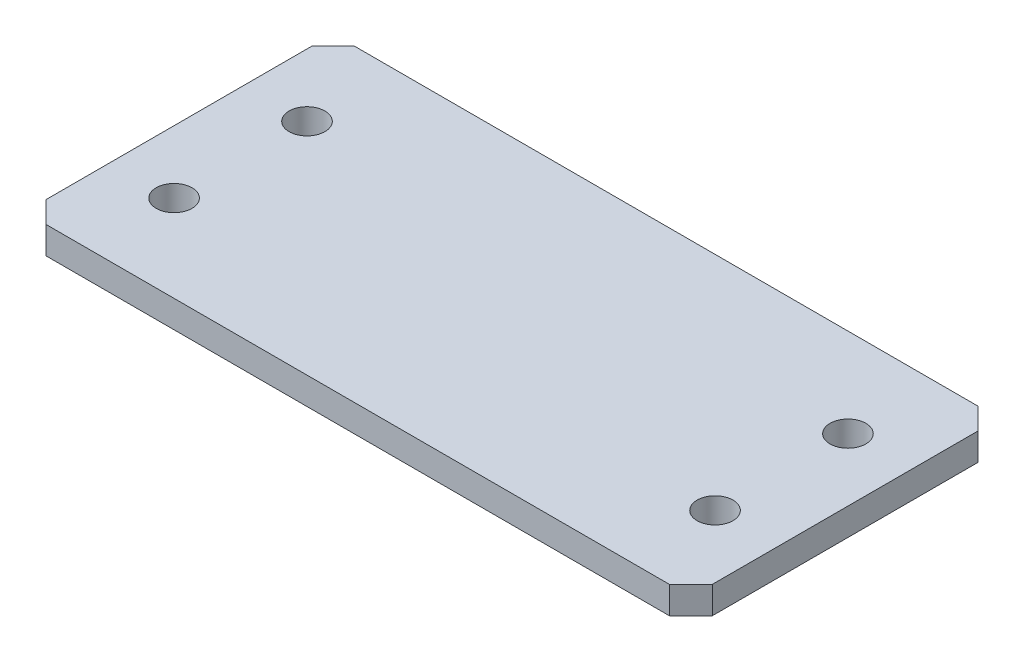
ISO-10303-21;
HEADER;
FILE_DESCRIPTION(('STEP AP214'),'2;1');
FILE_NAME('part.step','',(''),(''),'','','');
FILE_SCHEMA(('AUTOMOTIVE_DESIGN { 1 0 10303 214 1 1 1 1 }'));
ENDSEC;
DATA;
#1=APPLICATION_CONTEXT('core data for automotive mechanical design processes');
#2=APPLICATION_PROTOCOL_DEFINITION('international standard','automotive_design',2000,#1);
#3=PRODUCT_CONTEXT('',#1,'mechanical');
#4=PRODUCT('Part','Part','',(#3));
#5=PRODUCT_RELATED_PRODUCT_CATEGORY('part','',(#4));
#6=PRODUCT_DEFINITION_FORMATION('','',#4);
#7=PRODUCT_DEFINITION_CONTEXT('part definition',#1,'design');
#8=PRODUCT_DEFINITION('design','',#6,#7);
#9=PRODUCT_DEFINITION_SHAPE('','',#8);
#10=(LENGTH_UNIT() NAMED_UNIT(*) SI_UNIT(.MILLI.,.METRE.));
#11=(NAMED_UNIT(*) PLANE_ANGLE_UNIT() SI_UNIT($,.RADIAN.));
#12=(NAMED_UNIT(*) SI_UNIT($,.STERADIAN.) SOLID_ANGLE_UNIT());
#13=UNCERTAINTY_MEASURE_WITH_UNIT(LENGTH_MEASURE(1.E-05),#10,'distance_accuracy_value','');
#14=(GEOMETRIC_REPRESENTATION_CONTEXT(3) GLOBAL_UNCERTAINTY_ASSIGNED_CONTEXT((#13)) GLOBAL_UNIT_ASSIGNED_CONTEXT((#10,
#11,#12)) REPRESENTATION_CONTEXT('',''));
#15=CARTESIAN_POINT('',(0.,0.,0.));
#16=DIRECTION('',(0.,0.,1.));
#17=DIRECTION('',(1.,0.,0.));
#18=AXIS2_PLACEMENT_3D('',#15,#16,#17);
#19=CARTESIAN_POINT('',(18.6,0.,8.615));
#20=DIRECTION('',(0.,1.,0.));
#21=DIRECTION('',(0.,0.,1.));
#22=AXIS2_PLACEMENT_3D('',#19,#20,#21);
#23=PLANE('',#22);
#24=CARTESIAN_POINT('',(33.7,0.,12.38));
#25=DIRECTION('',(0.,-1.,0.));
#26=DIRECTION('',(0.,0.,-1.));
#27=AXIS2_PLACEMENT_3D('',#24,#25,#26);
#28=CIRCLE('',#27,1.);
#29=CARTESIAN_POINT('',(33.7,0.,11.38));
#30=VERTEX_POINT('',#29);
#31=EDGE_CURVE('E116',#30,#30,#28,.F.);
#32=ORIENTED_EDGE('',*,*,#31,.T.);
#33=EDGE_LOOP('',(#32));
#34=FACE_BOUND('',#33,.T.);
#35=CARTESIAN_POINT('',(3.5,0.,4.96));
#36=DIRECTION('',(0.,-1.,0.));
#37=DIRECTION('',(0.,0.,-1.));
#38=AXIS2_PLACEMENT_3D('',#35,#36,#37);
#39=CIRCLE('',#38,1.);
#40=CARTESIAN_POINT('',(3.5,0.,3.96));
#41=VERTEX_POINT('',#40);
#42=EDGE_CURVE('E120',#41,#41,#39,.F.);
#43=ORIENTED_EDGE('',*,*,#42,.T.);
#44=EDGE_LOOP('',(#43));
#45=FACE_BOUND('',#44,.T.);
#46=CARTESIAN_POINT('',(33.7,0.,4.96));
#47=DIRECTION('',(0.,-1.,0.));
#48=DIRECTION('',(0.,0.,-1.));
#49=AXIS2_PLACEMENT_3D('',#46,#47,#48);
#50=CIRCLE('',#49,1.);
#51=CARTESIAN_POINT('',(33.7,0.,3.96));
#52=VERTEX_POINT('',#51);
#53=EDGE_CURVE('E122',#52,#52,#50,.F.);
#54=ORIENTED_EDGE('',*,*,#53,.T.);
#55=EDGE_LOOP('',(#54));
#56=FACE_BOUND('',#55,.T.);
#57=CARTESIAN_POINT('',(3.5,0.,12.38));
#58=DIRECTION('',(0.,-1.,0.));
#59=DIRECTION('',(0.,0.,-1.));
#60=AXIS2_PLACEMENT_3D('',#57,#58,#59);
#61=CIRCLE('',#60,1.);
#62=CARTESIAN_POINT('',(3.5,0.,11.38));
#63=VERTEX_POINT('',#62);
#64=EDGE_CURVE('E20',#63,#63,#61,.F.);
#65=ORIENTED_EDGE('',*,*,#64,.T.);
#66=EDGE_LOOP('',(#65));
#67=FACE_BOUND('',#66,.T.);
#68=DIRECTION('',(1.,0.,0.));
#69=VECTOR('',#68,1.);
#70=CARTESIAN_POINT('',(1.2,0.,17.23));
#71=LINE('',#70,#69);
#72=CARTESIAN_POINT('',(1.2,0.,17.23));
#73=VERTEX_POINT('',#72);
#74=CARTESIAN_POINT('',(36.,0.,17.23));
#75=VERTEX_POINT('',#74);
#76=EDGE_CURVE('E131',#73,#75,#71,.T.);
#77=ORIENTED_EDGE('',*,*,#76,.F.);
#78=DIRECTION('',(0.707106781186548,0.,0.707106781186548));
#79=VECTOR('',#78,1.);
#80=CARTESIAN_POINT('',(0.,0.,16.03));
#81=LINE('',#80,#79);
#82=CARTESIAN_POINT('',(0.,0.,16.03));
#83=VERTEX_POINT('',#82);
#84=EDGE_CURVE('E140',#83,#73,#81,.T.);
#85=ORIENTED_EDGE('',*,*,#84,.F.);
#86=DIRECTION('',(0.,0.,1.));
#87=VECTOR('',#86,1.);
#88=CARTESIAN_POINT('',(0.,0.,1.2));
#89=LINE('',#88,#87);
#90=CARTESIAN_POINT('',(0.,0.,1.2));
#91=VERTEX_POINT('',#90);
#92=EDGE_CURVE('E145',#91,#83,#89,.T.);
#93=ORIENTED_EDGE('',*,*,#92,.F.);
#94=DIRECTION('',(-0.707106781186548,0.,0.707106781186548));
#95=VECTOR('',#94,1.);
#96=CARTESIAN_POINT('',(1.2,0.,0.));
#97=LINE('',#96,#95);
#98=CARTESIAN_POINT('',(1.2,0.,0.));
#99=VERTEX_POINT('',#98);
#100=EDGE_CURVE('E151',#99,#91,#97,.T.);
#101=ORIENTED_EDGE('',*,*,#100,.F.);
#102=DIRECTION('',(-1.,0.,0.));
#103=VECTOR('',#102,1.);
#104=CARTESIAN_POINT('',(36.,0.,0.));
#105=LINE('',#104,#103);
#106=CARTESIAN_POINT('',(36.,0.,0.));
#107=VERTEX_POINT('',#106);
#108=EDGE_CURVE('E157',#107,#99,#105,.T.);
#109=ORIENTED_EDGE('',*,*,#108,.F.);
#110=DIRECTION('',(-0.707106781186548,0.,-0.707106781186548));
#111=VECTOR('',#110,1.);
#112=CARTESIAN_POINT('',(37.2,0.,1.2));
#113=LINE('',#112,#111);
#114=CARTESIAN_POINT('',(37.2,0.,1.2));
#115=VERTEX_POINT('',#114);
#116=EDGE_CURVE('E80',#115,#107,#113,.T.);
#117=ORIENTED_EDGE('',*,*,#116,.F.);
#118=DIRECTION('',(0.,0.,-1.));
#119=VECTOR('',#118,1.);
#120=CARTESIAN_POINT('',(37.2,0.,16.03));
#121=LINE('',#120,#119);
#122=CARTESIAN_POINT('',(37.2,0.,16.03));
#123=VERTEX_POINT('',#122);
#124=EDGE_CURVE('E82',#123,#115,#121,.T.);
#125=ORIENTED_EDGE('',*,*,#124,.F.);
#126=DIRECTION('',(0.707106781186548,0.,-0.707106781186548));
#127=VECTOR('',#126,1.);
#128=CARTESIAN_POINT('',(36.,0.,17.23));
#129=LINE('',#128,#127);
#130=EDGE_CURVE('E84',#75,#123,#129,.T.);
#131=ORIENTED_EDGE('',*,*,#130,.F.);
#132=EDGE_LOOP('',(#77,#85,#93,#101,#109,#117,#125,#131));
#133=FACE_BOUND('',#132,.T.);
#134=ADVANCED_FACE('F17',(#34,#45,#56,#67,#133),#23,.F.);
#135=CARTESIAN_POINT('',(36.,0.,17.23));
#136=DIRECTION('',(0.707106781186548,0.,0.707106781186548));
#137=DIRECTION('',(0.707106781186548,0.,-0.707106781186548));
#138=AXIS2_PLACEMENT_3D('',#135,#136,#137);
#139=PLANE('',#138);
#140=DIRECTION('',(0.707106781186547,0.,-0.707106781186547));
#141=VECTOR('',#140,1.);
#142=CARTESIAN_POINT('',(36.,1.52,17.23));
#143=LINE('',#142,#141);
#144=CARTESIAN_POINT('',(36.,1.52,17.23));
#145=VERTEX_POINT('',#144);
#146=CARTESIAN_POINT('',(37.2,1.52,16.03));
#147=VERTEX_POINT('',#146);
#148=EDGE_CURVE('E119',#145,#147,#143,.T.);
#149=ORIENTED_EDGE('',*,*,#148,.F.);
#150=DIRECTION('',(0.,1.,0.));
#151=VECTOR('',#150,1.);
#152=CARTESIAN_POINT('',(36.,0.,17.23));
#153=LINE('',#152,#151);
#154=EDGE_CURVE('E95',#75,#145,#153,.T.);
#155=ORIENTED_EDGE('',*,*,#154,.F.);
#156=ORIENTED_EDGE('',*,*,#130,.T.);
#157=DIRECTION('',(0.,1.,0.));
#158=VECTOR('',#157,1.);
#159=CARTESIAN_POINT('',(37.2,0.,16.03));
#160=LINE('',#159,#158);
#161=EDGE_CURVE('E89',#147,#123,#160,.F.);
#162=ORIENTED_EDGE('',*,*,#161,.F.);
#163=EDGE_LOOP('',(#149,#155,#156,#162));
#164=FACE_BOUND('',#163,.T.);
#165=ADVANCED_FACE('F92',(#164),#139,.T.);
#166=CARTESIAN_POINT('',(37.2,0.,16.03));
#167=DIRECTION('',(1.,0.,0.));
#168=DIRECTION('',(0.,0.,-1.));
#169=AXIS2_PLACEMENT_3D('',#166,#167,#168);
#170=PLANE('',#169);
#171=DIRECTION('',(0.,0.,1.));
#172=VECTOR('',#171,1.);
#173=CARTESIAN_POINT('',(37.2,1.52,8.615));
#174=LINE('',#173,#172);
#175=CARTESIAN_POINT('',(37.2,1.52,1.2));
#176=VERTEX_POINT('',#175);
#177=EDGE_CURVE('E100',#147,#176,#174,.F.);
#178=ORIENTED_EDGE('',*,*,#177,.F.);
#179=ORIENTED_EDGE('',*,*,#161,.T.);
#180=ORIENTED_EDGE('',*,*,#124,.T.);
#181=DIRECTION('',(0.,1.,0.));
#182=VECTOR('',#181,1.);
#183=CARTESIAN_POINT('',(37.2,0.,1.2));
#184=LINE('',#183,#182);
#185=EDGE_CURVE('E103',#176,#115,#184,.F.);
#186=ORIENTED_EDGE('',*,*,#185,.F.);
#187=EDGE_LOOP('',(#178,#179,#180,#186));
#188=FACE_BOUND('',#187,.T.);
#189=ADVANCED_FACE('F98',(#188),#170,.T.);
#190=CARTESIAN_POINT('',(37.2,0.,1.2));
#191=DIRECTION('',(0.707106781186548,0.,-0.707106781186548));
#192=DIRECTION('',(-0.707106781186548,0.,-0.707106781186548));
#193=AXIS2_PLACEMENT_3D('',#190,#191,#192);
#194=PLANE('',#193);
#195=DIRECTION('',(-0.707106781186547,0.,-0.707106781186547));
#196=VECTOR('',#195,1.);
#197=CARTESIAN_POINT('',(37.2,1.52,1.2));
#198=LINE('',#197,#196);
#199=CARTESIAN_POINT('',(36.,1.52,0.));
#200=VERTEX_POINT('',#199);
#201=EDGE_CURVE('E163',#176,#200,#198,.T.);
#202=ORIENTED_EDGE('',*,*,#201,.F.);
#203=ORIENTED_EDGE('',*,*,#185,.T.);
#204=ORIENTED_EDGE('',*,*,#116,.T.);
#205=DIRECTION('',(0.,1.,0.));
#206=VECTOR('',#205,1.);
#207=CARTESIAN_POINT('',(36.,0.,0.));
#208=LINE('',#207,#206);
#209=EDGE_CURVE('E154',#200,#107,#208,.F.);
#210=ORIENTED_EDGE('',*,*,#209,.F.);
#211=EDGE_LOOP('',(#202,#203,#204,#210));
#212=FACE_BOUND('',#211,.T.);
#213=ADVANCED_FACE('F161',(#212),#194,.T.);
#214=CARTESIAN_POINT('',(36.,0.,0.));
#215=DIRECTION('',(0.,0.,-1.));
#216=DIRECTION('',(-1.,0.,0.));
#217=AXIS2_PLACEMENT_3D('',#214,#215,#216);
#218=PLANE('',#217);
#219=DIRECTION('',(1.,0.,0.));
#220=VECTOR('',#219,1.);
#221=CARTESIAN_POINT('',(18.6,1.52,0.));
#222=LINE('',#221,#220);
#223=CARTESIAN_POINT('',(1.2,1.52,0.));
#224=VERTEX_POINT('',#223);
#225=EDGE_CURVE('E167',#200,#224,#222,.F.);
#226=ORIENTED_EDGE('',*,*,#225,.F.);
#227=ORIENTED_EDGE('',*,*,#209,.T.);
#228=ORIENTED_EDGE('',*,*,#108,.T.);
#229=DIRECTION('',(0.,1.,0.));
#230=VECTOR('',#229,1.);
#231=CARTESIAN_POINT('',(1.2,0.,0.));
#232=LINE('',#231,#230);
#233=EDGE_CURVE('E148',#224,#99,#232,.F.);
#234=ORIENTED_EDGE('',*,*,#233,.F.);
#235=EDGE_LOOP('',(#226,#227,#228,#234));
#236=FACE_BOUND('',#235,.T.);
#237=ADVANCED_FACE('F191',(#236),#218,.T.);
#238=CARTESIAN_POINT('',(1.2,0.,0.));
#239=DIRECTION('',(-0.707106781186548,0.,-0.707106781186548));
#240=DIRECTION('',(-0.707106781186548,0.,0.707106781186548));
#241=AXIS2_PLACEMENT_3D('',#238,#239,#240);
#242=PLANE('',#241);
#243=DIRECTION('',(-0.707106781186547,0.,0.707106781186547));
#244=VECTOR('',#243,1.);
#245=CARTESIAN_POINT('',(1.2,1.52,0.));
#246=LINE('',#245,#244);
#247=CARTESIAN_POINT('',(0.,1.52,1.2));
#248=VERTEX_POINT('',#247);
#249=EDGE_CURVE('E174',#224,#248,#246,.T.);
#250=ORIENTED_EDGE('',*,*,#249,.F.);
#251=ORIENTED_EDGE('',*,*,#233,.T.);
#252=ORIENTED_EDGE('',*,*,#100,.T.);
#253=DIRECTION('',(0.,1.,0.));
#254=VECTOR('',#253,1.);
#255=CARTESIAN_POINT('',(0.,0.,1.2));
#256=LINE('',#255,#254);
#257=EDGE_CURVE('E142',#248,#91,#256,.F.);
#258=ORIENTED_EDGE('',*,*,#257,.F.);
#259=EDGE_LOOP('',(#250,#251,#252,#258));
#260=FACE_BOUND('',#259,.T.);
#261=ADVANCED_FACE('F189',(#260),#242,.T.);
#262=CARTESIAN_POINT('',(0.,0.,1.2));
#263=DIRECTION('',(-1.,0.,0.));
#264=DIRECTION('',(0.,0.,1.));
#265=AXIS2_PLACEMENT_3D('',#262,#263,#264);
#266=PLANE('',#265);
#267=DIRECTION('',(0.,0.,1.));
#268=VECTOR('',#267,1.);
#269=CARTESIAN_POINT('',(0.,1.52,8.615));
#270=LINE('',#269,#268);
#271=CARTESIAN_POINT('',(0.,1.52,16.03));
#272=VERTEX_POINT('',#271);
#273=EDGE_CURVE('E177',#248,#272,#270,.T.);
#274=ORIENTED_EDGE('',*,*,#273,.F.);
#275=ORIENTED_EDGE('',*,*,#257,.T.);
#276=ORIENTED_EDGE('',*,*,#92,.T.);
#277=DIRECTION('',(0.,1.,0.));
#278=VECTOR('',#277,1.);
#279=CARTESIAN_POINT('',(0.,0.,16.03));
#280=LINE('',#279,#278);
#281=EDGE_CURVE('E137',#272,#83,#280,.F.);
#282=ORIENTED_EDGE('',*,*,#281,.F.);
#283=EDGE_LOOP('',(#274,#275,#276,#282));
#284=FACE_BOUND('',#283,.T.);
#285=ADVANCED_FACE('F186',(#284),#266,.T.);
#286=CARTESIAN_POINT('',(0.,0.,16.03));
#287=DIRECTION('',(-0.707106781186548,0.,0.707106781186548));
#288=DIRECTION('',(0.707106781186548,0.,0.707106781186548));
#289=AXIS2_PLACEMENT_3D('',#286,#287,#288);
#290=PLANE('',#289);
#291=DIRECTION('',(0.707106781186547,0.,0.707106781186547));
#292=VECTOR('',#291,1.);
#293=CARTESIAN_POINT('',(0.,1.52,16.03));
#294=LINE('',#293,#292);
#295=CARTESIAN_POINT('',(1.2,1.52,17.23));
#296=VERTEX_POINT('',#295);
#297=EDGE_CURVE('E180',#272,#296,#294,.T.);
#298=ORIENTED_EDGE('',*,*,#297,.F.);
#299=ORIENTED_EDGE('',*,*,#281,.T.);
#300=ORIENTED_EDGE('',*,*,#84,.T.);
#301=DIRECTION('',(0.,1.,0.));
#302=VECTOR('',#301,1.);
#303=CARTESIAN_POINT('',(1.2,0.,17.23));
#304=LINE('',#303,#302);
#305=EDGE_CURVE('E35',#296,#73,#304,.F.);
#306=ORIENTED_EDGE('',*,*,#305,.F.);
#307=EDGE_LOOP('',(#298,#299,#300,#306));
#308=FACE_BOUND('',#307,.T.);
#309=ADVANCED_FACE('F183',(#308),#290,.T.);
#310=CARTESIAN_POINT('',(1.2,0.,17.23));
#311=DIRECTION('',(0.,0.,1.));
#312=DIRECTION('',(1.,0.,0.));
#313=AXIS2_PLACEMENT_3D('',#310,#311,#312);
#314=PLANE('',#313);
#315=DIRECTION('',(1.,0.,0.));
#316=VECTOR('',#315,1.);
#317=CARTESIAN_POINT('',(18.6,1.52,17.23));
#318=LINE('',#317,#316);
#319=EDGE_CURVE('E115',#296,#145,#318,.T.);
#320=ORIENTED_EDGE('',*,*,#319,.F.);
#321=ORIENTED_EDGE('',*,*,#305,.T.);
#322=ORIENTED_EDGE('',*,*,#76,.T.);
#323=ORIENTED_EDGE('',*,*,#154,.T.);
#324=EDGE_LOOP('',(#320,#321,#322,#323));
#325=FACE_BOUND('',#324,.T.);
#326=ADVANCED_FACE('F182',(#325),#314,.T.);
#327=CARTESIAN_POINT('',(3.5,1.52,12.38));
#328=DIRECTION('',(0.,-1.,0.));
#329=DIRECTION('',(0.,0.,-1.));
#330=AXIS2_PLACEMENT_3D('',#327,#328,#329);
#331=CYLINDRICAL_SURFACE('',#330,1.);
#332=ORIENTED_EDGE('',*,*,#64,.F.);
#333=EDGE_LOOP('',(#332));
#334=FACE_BOUND('',#333,.T.);
#335=CARTESIAN_POINT('',(3.5,1.52,12.38));
#336=DIRECTION('',(0.,-1.,0.));
#337=DIRECTION('',(0.,0.,-1.));
#338=AXIS2_PLACEMENT_3D('',#335,#336,#337);
#339=CIRCLE('',#338,1.);
#340=CARTESIAN_POINT('',(3.5,1.52,11.38));
#341=VERTEX_POINT('',#340);
#342=EDGE_CURVE('E112',#341,#341,#339,.T.);
#343=ORIENTED_EDGE('',*,*,#342,.F.);
#344=EDGE_LOOP('',(#343));
#345=FACE_BOUND('',#344,.T.);
#346=ADVANCED_FACE('F219',(#334,#345),#331,.F.);
#347=CARTESIAN_POINT('',(33.7,1.52,4.96));
#348=DIRECTION('',(0.,-1.,0.));
#349=DIRECTION('',(0.,0.,-1.));
#350=AXIS2_PLACEMENT_3D('',#347,#348,#349);
#351=CYLINDRICAL_SURFACE('',#350,1.);
#352=ORIENTED_EDGE('',*,*,#53,.F.);
#353=EDGE_LOOP('',(#352));
#354=FACE_BOUND('',#353,.T.);
#355=CARTESIAN_POINT('',(33.7,1.52,4.96));
#356=DIRECTION('',(0.,-1.,0.));
#357=DIRECTION('',(0.,0.,-1.));
#358=AXIS2_PLACEMENT_3D('',#355,#356,#357);
#359=CIRCLE('',#358,1.);
#360=CARTESIAN_POINT('',(33.7,1.52,3.96));
#361=VERTEX_POINT('',#360);
#362=EDGE_CURVE('E109',#361,#361,#359,.T.);
#363=ORIENTED_EDGE('',*,*,#362,.F.);
#364=EDGE_LOOP('',(#363));
#365=FACE_BOUND('',#364,.T.);
#366=ADVANCED_FACE('F215',(#354,#365),#351,.F.);
#367=CARTESIAN_POINT('',(3.5,1.52,4.96));
#368=DIRECTION('',(0.,-1.,0.));
#369=DIRECTION('',(0.,0.,-1.));
#370=AXIS2_PLACEMENT_3D('',#367,#368,#369);
#371=CYLINDRICAL_SURFACE('',#370,1.);
#372=ORIENTED_EDGE('',*,*,#42,.F.);
#373=EDGE_LOOP('',(#372));
#374=FACE_BOUND('',#373,.T.);
#375=CARTESIAN_POINT('',(3.5,1.52,4.96));
#376=DIRECTION('',(0.,-1.,0.));
#377=DIRECTION('',(0.,0.,-1.));
#378=AXIS2_PLACEMENT_3D('',#375,#376,#377);
#379=CIRCLE('',#378,1.);
#380=CARTESIAN_POINT('',(3.5,1.52,3.96));
#381=VERTEX_POINT('',#380);
#382=EDGE_CURVE('E26',#381,#381,#379,.T.);
#383=ORIENTED_EDGE('',*,*,#382,.F.);
#384=EDGE_LOOP('',(#383));
#385=FACE_BOUND('',#384,.T.);
#386=ADVANCED_FACE('F208',(#374,#385),#371,.F.);
#387=CARTESIAN_POINT('',(33.7,1.52,12.38));
#388=DIRECTION('',(0.,-1.,0.));
#389=DIRECTION('',(0.,0.,-1.));
#390=AXIS2_PLACEMENT_3D('',#387,#388,#389);
#391=CYLINDRICAL_SURFACE('',#390,1.);
#392=ORIENTED_EDGE('',*,*,#31,.F.);
#393=EDGE_LOOP('',(#392));
#394=FACE_BOUND('',#393,.T.);
#395=CARTESIAN_POINT('',(33.7,1.52,12.38));
#396=DIRECTION('',(0.,-1.,0.));
#397=DIRECTION('',(0.,0.,-1.));
#398=AXIS2_PLACEMENT_3D('',#395,#396,#397);
#399=CIRCLE('',#398,1.);
#400=CARTESIAN_POINT('',(33.7,1.52,11.38));
#401=VERTEX_POINT('',#400);
#402=EDGE_CURVE('E11',#401,#401,#399,.T.);
#403=ORIENTED_EDGE('',*,*,#402,.F.);
#404=EDGE_LOOP('',(#403));
#405=FACE_BOUND('',#404,.T.);
#406=ADVANCED_FACE('F202',(#394,#405),#391,.F.);
#407=CARTESIAN_POINT('',(18.6,1.52,8.615));
#408=DIRECTION('',(0.,1.,0.));
#409=DIRECTION('',(0.,0.,1.));
#410=AXIS2_PLACEMENT_3D('',#407,#408,#409);
#411=PLANE('',#410);
#412=ORIENTED_EDGE('',*,*,#402,.T.);
#413=EDGE_LOOP('',(#412));
#414=FACE_BOUND('',#413,.T.);
#415=ORIENTED_EDGE('',*,*,#382,.T.);
#416=EDGE_LOOP('',(#415));
#417=FACE_BOUND('',#416,.T.);
#418=ORIENTED_EDGE('',*,*,#362,.T.);
#419=EDGE_LOOP('',(#418));
#420=FACE_BOUND('',#419,.T.);
#421=ORIENTED_EDGE('',*,*,#342,.T.);
#422=EDGE_LOOP('',(#421));
#423=FACE_BOUND('',#422,.T.);
#424=ORIENTED_EDGE('',*,*,#297,.T.);
#425=ORIENTED_EDGE('',*,*,#319,.T.);
#426=ORIENTED_EDGE('',*,*,#148,.T.);
#427=ORIENTED_EDGE('',*,*,#177,.T.);
#428=ORIENTED_EDGE('',*,*,#201,.T.);
#429=ORIENTED_EDGE('',*,*,#225,.T.);
#430=ORIENTED_EDGE('',*,*,#249,.T.);
#431=ORIENTED_EDGE('',*,*,#273,.T.);
#432=EDGE_LOOP('',(#424,#425,#426,#427,#428,#429,#430,#431));
#433=FACE_BOUND('',#432,.T.);
#434=ADVANCED_FACE('F170',(#414,#417,#420,#423,#433),#411,.T.);
#435=CLOSED_SHELL('',(#134,#165,#189,#213,#237,#261,#285,#309,#326,#346,#366,#386,#406,#434));
#436=MANIFOLD_SOLID_BREP('B1',#435);
#437=ADVANCED_BREP_SHAPE_REPRESENTATION('',(#18,#436),#14);
#438=SHAPE_DEFINITION_REPRESENTATION(#9,#437);
ENDSEC;
END-ISO-10303-21;
